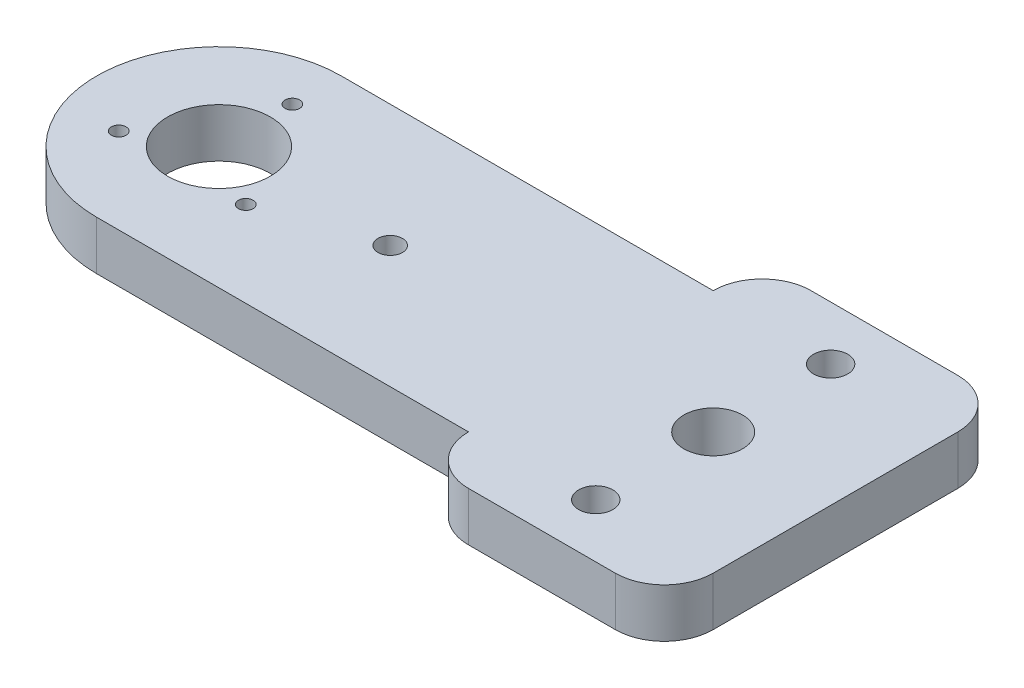
ISO-10303-21;
HEADER;
FILE_DESCRIPTION(('STEP AP214'),'2;1');
FILE_NAME('part.step','',(''),(''),'','','');
FILE_SCHEMA(('AUTOMOTIVE_DESIGN { 1 0 10303 214 1 1 1 1 }'));
ENDSEC;
DATA;
#1=APPLICATION_CONTEXT('core data for automotive mechanical design processes');
#2=APPLICATION_PROTOCOL_DEFINITION('international standard','automotive_design',2000,#1);
#3=PRODUCT_CONTEXT('',#1,'mechanical');
#4=PRODUCT('Part','Part','',(#3));
#5=PRODUCT_RELATED_PRODUCT_CATEGORY('part','',(#4));
#6=PRODUCT_DEFINITION_FORMATION('','',#4);
#7=PRODUCT_DEFINITION_CONTEXT('part definition',#1,'design');
#8=PRODUCT_DEFINITION('design','',#6,#7);
#9=PRODUCT_DEFINITION_SHAPE('','',#8);
#10=(LENGTH_UNIT() NAMED_UNIT(*) SI_UNIT(.MILLI.,.METRE.));
#11=(NAMED_UNIT(*) PLANE_ANGLE_UNIT() SI_UNIT($,.RADIAN.));
#12=(NAMED_UNIT(*) SI_UNIT($,.STERADIAN.) SOLID_ANGLE_UNIT());
#13=UNCERTAINTY_MEASURE_WITH_UNIT(LENGTH_MEASURE(1.E-05),#10,'distance_accuracy_value','');
#14=(GEOMETRIC_REPRESENTATION_CONTEXT(3) GLOBAL_UNCERTAINTY_ASSIGNED_CONTEXT((#13)) GLOBAL_UNIT_ASSIGNED_CONTEXT((#10,
#11,#12)) REPRESENTATION_CONTEXT('',''));
#15=CARTESIAN_POINT('',(0.,0.,0.));
#16=DIRECTION('',(0.,0.,1.));
#17=DIRECTION('',(1.,0.,0.));
#18=AXIS2_PLACEMENT_3D('',#15,#16,#17);
#19=CARTESIAN_POINT('',(126.000002702877,10.,0.));
#20=DIRECTION('',(-1.,0.,0.));
#21=DIRECTION('',(0.,0.,1.));
#22=AXIS2_PLACEMENT_3D('',#19,#20,#21);
#23=PLANE('',#22);
#24=DIRECTION('',(0.,0.,-1.));
#25=VECTOR('',#24,1.);
#26=CARTESIAN_POINT('',(126.000002702877,0.,0.));
#27=LINE('',#26,#25);
#28=CARTESIAN_POINT('',(126.000002702877,0.,25.));
#29=VERTEX_POINT('',#28);
#30=CARTESIAN_POINT('',(126.000002702877,0.,-25.));
#31=VERTEX_POINT('',#30);
#32=EDGE_CURVE('E205',#29,#31,#27,.T.);
#33=ORIENTED_EDGE('',*,*,#32,.T.);
#34=DIRECTION('',(0.,-1.,0.));
#35=VECTOR('',#34,1.);
#36=CARTESIAN_POINT('',(126.000002702877,10.,-25.));
#37=LINE('',#36,#35);
#38=CARTESIAN_POINT('',(126.000002702877,10.,-25.));
#39=VERTEX_POINT('',#38);
#40=EDGE_CURVE('E56',#31,#39,#37,.F.);
#41=ORIENTED_EDGE('',*,*,#40,.T.);
#42=DIRECTION('',(0.,0.,-1.));
#43=VECTOR('',#42,1.);
#44=CARTESIAN_POINT('',(126.000002702877,10.,0.));
#45=LINE('',#44,#43);
#46=CARTESIAN_POINT('',(126.000002702877,10.,25.));
#47=VERTEX_POINT('',#46);
#48=EDGE_CURVE('E375',#47,#39,#45,.T.);
#49=ORIENTED_EDGE('',*,*,#48,.F.);
#50=DIRECTION('',(0.,-1.,0.));
#51=VECTOR('',#50,1.);
#52=CARTESIAN_POINT('',(126.000002702877,10.,25.));
#53=LINE('',#52,#51);
#54=EDGE_CURVE('E154',#47,#29,#53,.T.);
#55=ORIENTED_EDGE('',*,*,#54,.T.);
#56=EDGE_LOOP('',(#33,#41,#49,#55));
#57=FACE_BOUND('',#56,.T.);
#58=ADVANCED_FACE('F47',(#57),#23,.F.);
#59=CARTESIAN_POINT('',(0.,10.,-35.));
#60=DIRECTION('',(0.,0.,-1.));
#61=DIRECTION('',(-1.,0.,0.));
#62=AXIS2_PLACEMENT_3D('',#59,#60,#61);
#63=PLANE('',#62);
#64=DIRECTION('',(1.,0.,0.));
#65=VECTOR('',#64,1.);
#66=CARTESIAN_POINT('',(0.,10.,-35.));
#67=LINE('',#66,#65);
#68=CARTESIAN_POINT('',(86.000002702877,10.,-35.));
#69=VERTEX_POINT('',#68);
#70=CARTESIAN_POINT('',(116.000002702877,10.,-35.));
#71=VERTEX_POINT('',#70);
#72=EDGE_CURVE('E132',#69,#71,#67,.T.);
#73=ORIENTED_EDGE('',*,*,#72,.T.);
#74=DIRECTION('',(0.,-1.,0.));
#75=VECTOR('',#74,1.);
#76=CARTESIAN_POINT('',(116.000002702877,0.,-35.));
#77=LINE('',#76,#75);
#78=CARTESIAN_POINT('',(116.000002702877,0.,-35.));
#79=VERTEX_POINT('',#78);
#80=EDGE_CURVE('E137',#71,#79,#77,.T.);
#81=ORIENTED_EDGE('',*,*,#80,.T.);
#82=DIRECTION('',(1.,0.,0.));
#83=VECTOR('',#82,1.);
#84=CARTESIAN_POINT('',(0.,0.,-35.));
#85=LINE('',#84,#83);
#86=CARTESIAN_POINT('',(86.000002702877,0.,-35.));
#87=VERTEX_POINT('',#86);
#88=EDGE_CURVE('E198',#87,#79,#85,.T.);
#89=ORIENTED_EDGE('',*,*,#88,.F.);
#90=DIRECTION('',(0.,-1.,0.));
#91=VECTOR('',#90,1.);
#92=CARTESIAN_POINT('',(86.000002702877,10.,-35.));
#93=LINE('',#92,#91);
#94=EDGE_CURVE('E138',#87,#69,#93,.F.);
#95=ORIENTED_EDGE('',*,*,#94,.T.);
#96=EDGE_LOOP('',(#73,#81,#89,#95));
#97=FACE_BOUND('',#96,.T.);
#98=ADVANCED_FACE('F197',(#97),#63,.T.);
#99=CARTESIAN_POINT('',(0.,10.,-25.));
#100=DIRECTION('',(0.,0.,-1.));
#101=DIRECTION('',(-1.,0.,0.));
#102=AXIS2_PLACEMENT_3D('',#99,#100,#101);
#103=PLANE('',#102);
#104=DIRECTION('',(1.,0.,0.));
#105=VECTOR('',#104,1.);
#106=CARTESIAN_POINT('',(0.,0.,-25.));
#107=LINE('',#106,#105);
#108=CARTESIAN_POINT('',(0.,0.,-25.));
#109=VERTEX_POINT('',#108);
#110=CARTESIAN_POINT('',(76.000002702877,0.,-25.));
#111=VERTEX_POINT('',#110);
#112=EDGE_CURVE('E204',#109,#111,#107,.T.);
#113=ORIENTED_EDGE('',*,*,#112,.F.);
#114=DIRECTION('',(0.,-1.,0.));
#115=VECTOR('',#114,1.);
#116=CARTESIAN_POINT('',(0.,10.,-25.));
#117=LINE('',#116,#115);
#118=CARTESIAN_POINT('',(0.,10.,-25.));
#119=VERTEX_POINT('',#118);
#120=EDGE_CURVE('E146',#119,#109,#117,.T.);
#121=ORIENTED_EDGE('',*,*,#120,.F.);
#122=DIRECTION('',(1.,0.,0.));
#123=VECTOR('',#122,1.);
#124=CARTESIAN_POINT('',(0.,10.,-25.));
#125=LINE('',#124,#123);
#126=CARTESIAN_POINT('',(76.000002702877,10.,-25.));
#127=VERTEX_POINT('',#126);
#128=EDGE_CURVE('E130',#119,#127,#125,.T.);
#129=ORIENTED_EDGE('',*,*,#128,.T.);
#130=DIRECTION('',(0.,-1.,0.));
#131=VECTOR('',#130,1.);
#132=CARTESIAN_POINT('',(76.000002702877,10.,-25.));
#133=LINE('',#132,#131);
#134=EDGE_CURVE('E144',#127,#111,#133,.T.);
#135=ORIENTED_EDGE('',*,*,#134,.T.);
#136=EDGE_LOOP('',(#113,#121,#129,#135));
#137=FACE_BOUND('',#136,.T.);
#138=ADVANCED_FACE('F143',(#137),#103,.T.);
#139=CARTESIAN_POINT('',(0.,10.,0.));
#140=DIRECTION('',(0.,-1.,0.));
#141=DIRECTION('',(0.,0.,-1.));
#142=AXIS2_PLACEMENT_3D('',#139,#140,#141);
#143=CYLINDRICAL_SURFACE('',#142,25.);
#144=CARTESIAN_POINT('',(0.,0.,0.));
#145=DIRECTION('',(0.,1.,0.));
#146=DIRECTION('',(0.,0.,1.));
#147=AXIS2_PLACEMENT_3D('',#144,#145,#146);
#148=CIRCLE('',#147,25.);
#149=CARTESIAN_POINT('',(0.,0.,25.));
#150=VERTEX_POINT('',#149);
#151=EDGE_CURVE('E209',#109,#150,#148,.T.);
#152=ORIENTED_EDGE('',*,*,#151,.T.);
#153=DIRECTION('',(0.,-1.,0.));
#154=VECTOR('',#153,1.);
#155=CARTESIAN_POINT('',(0.,10.,25.));
#156=LINE('',#155,#154);
#157=CARTESIAN_POINT('',(0.,10.,25.));
#158=VERTEX_POINT('',#157);
#159=EDGE_CURVE('E161',#158,#150,#156,.T.);
#160=ORIENTED_EDGE('',*,*,#159,.F.);
#161=CARTESIAN_POINT('',(0.,10.,0.));
#162=DIRECTION('',(0.,1.,0.));
#163=DIRECTION('',(0.,0.,1.));
#164=AXIS2_PLACEMENT_3D('',#161,#162,#163);
#165=CIRCLE('',#164,25.);
#166=EDGE_CURVE('E149',#119,#158,#165,.T.);
#167=ORIENTED_EDGE('',*,*,#166,.F.);
#168=ORIENTED_EDGE('',*,*,#120,.T.);
#169=EDGE_LOOP('',(#152,#160,#167,#168));
#170=FACE_BOUND('',#169,.T.);
#171=ADVANCED_FACE('F334',(#170),#143,.T.);
#172=CARTESIAN_POINT('',(0.,10.,25.));
#173=DIRECTION('',(0.,0.,-1.));
#174=DIRECTION('',(-1.,0.,0.));
#175=AXIS2_PLACEMENT_3D('',#172,#173,#174);
#176=PLANE('',#175);
#177=DIRECTION('',(1.,0.,0.));
#178=VECTOR('',#177,1.);
#179=CARTESIAN_POINT('',(0.,0.,25.));
#180=LINE('',#179,#178);
#181=CARTESIAN_POINT('',(76.000002702877,0.,25.));
#182=VERTEX_POINT('',#181);
#183=EDGE_CURVE('E217',#150,#182,#180,.T.);
#184=ORIENTED_EDGE('',*,*,#183,.T.);
#185=DIRECTION('',(0.,-1.,0.));
#186=VECTOR('',#185,1.);
#187=CARTESIAN_POINT('',(76.000002702877,10.,25.));
#188=LINE('',#187,#186);
#189=CARTESIAN_POINT('',(76.000002702877,10.,25.));
#190=VERTEX_POINT('',#189);
#191=EDGE_CURVE('E245',#190,#182,#188,.T.);
#192=ORIENTED_EDGE('',*,*,#191,.F.);
#193=DIRECTION('',(1.,0.,0.));
#194=VECTOR('',#193,1.);
#195=CARTESIAN_POINT('',(0.,10.,25.));
#196=LINE('',#195,#194);
#197=EDGE_CURVE('E257',#158,#190,#196,.T.);
#198=ORIENTED_EDGE('',*,*,#197,.F.);
#199=ORIENTED_EDGE('',*,*,#159,.T.);
#200=EDGE_LOOP('',(#184,#192,#198,#199));
#201=FACE_BOUND('',#200,.T.);
#202=ADVANCED_FACE('F255',(#201),#176,.F.);
#203=CARTESIAN_POINT('',(101.000002702877,10.,23.9999999999994));
#204=DIRECTION('',(0.,-1.,0.));
#205=DIRECTION('',(0.,0.,-1.));
#206=AXIS2_PLACEMENT_3D('',#203,#204,#205);
#207=CYLINDRICAL_SURFACE('',#206,3.50000000000213);
#208=CARTESIAN_POINT('',(101.000002702877,10.,23.9999999999994));
#209=DIRECTION('',(0.,1.,0.));
#210=DIRECTION('',(0.,0.,1.));
#211=AXIS2_PLACEMENT_3D('',#208,#209,#210);
#212=CIRCLE('',#211,3.50000000000213);
#213=CARTESIAN_POINT('',(101.000002702877,10.,27.5000000000015));
#214=VERTEX_POINT('',#213);
#215=EDGE_CURVE('E289',#214,#214,#212,.F.);
#216=ORIENTED_EDGE('',*,*,#215,.F.);
#217=EDGE_LOOP('',(#216));
#218=FACE_BOUND('',#217,.T.);
#219=CARTESIAN_POINT('',(101.000002702877,0.,23.9999999999994));
#220=DIRECTION('',(0.,1.,0.));
#221=DIRECTION('',(0.,0.,1.));
#222=AXIS2_PLACEMENT_3D('',#219,#220,#221);
#223=CIRCLE('',#222,3.50000000000213);
#224=CARTESIAN_POINT('',(101.000002702877,0.,27.5000000000015));
#225=VERTEX_POINT('',#224);
#226=EDGE_CURVE('E236',#225,#225,#223,.F.);
#227=ORIENTED_EDGE('',*,*,#226,.T.);
#228=EDGE_LOOP('',(#227));
#229=FACE_BOUND('',#228,.T.);
#230=ADVANCED_FACE('F338',(#218,#229),#207,.F.);
#231=CARTESIAN_POINT('',(35.,10.,0.));
#232=DIRECTION('',(0.,-1.,0.));
#233=DIRECTION('',(0.,0.,-1.));
#234=AXIS2_PLACEMENT_3D('',#231,#232,#233);
#235=CYLINDRICAL_SURFACE('',#234,2.5);
#236=CARTESIAN_POINT('',(35.,10.,0.));
#237=DIRECTION('',(0.,1.,0.));
#238=DIRECTION('',(0.,0.,1.));
#239=AXIS2_PLACEMENT_3D('',#236,#237,#238);
#240=CIRCLE('',#239,2.5);
#241=CARTESIAN_POINT('',(35.,10.,2.5));
#242=VERTEX_POINT('',#241);
#243=EDGE_CURVE('E285',#242,#242,#240,.T.);
#244=ORIENTED_EDGE('',*,*,#243,.T.);
#245=EDGE_LOOP('',(#244));
#246=FACE_BOUND('',#245,.T.);
#247=CARTESIAN_POINT('',(35.,0.,0.));
#248=DIRECTION('',(0.,1.,0.));
#249=DIRECTION('',(0.,0.,1.));
#250=AXIS2_PLACEMENT_3D('',#247,#248,#249);
#251=CIRCLE('',#250,2.5);
#252=CARTESIAN_POINT('',(35.,0.,2.5));
#253=VERTEX_POINT('',#252);
#254=EDGE_CURVE('E232',#253,#253,#251,.T.);
#255=ORIENTED_EDGE('',*,*,#254,.F.);
#256=EDGE_LOOP('',(#255));
#257=FACE_BOUND('',#256,.T.);
#258=ADVANCED_FACE('F345',(#246,#257),#235,.F.);
#259=CARTESIAN_POINT('',(0.,10.,-15.));
#260=DIRECTION('',(0.,-1.,0.));
#261=DIRECTION('',(0.,0.,-1.));
#262=AXIS2_PLACEMENT_3D('',#259,#260,#261);
#263=CYLINDRICAL_SURFACE('',#262,1.5);
#264=CARTESIAN_POINT('',(0.,10.,-15.));
#265=DIRECTION('',(0.,1.,0.));
#266=DIRECTION('',(0.,0.,1.));
#267=AXIS2_PLACEMENT_3D('',#264,#265,#266);
#268=CIRCLE('',#267,1.5);
#269=CARTESIAN_POINT('',(0.,10.,-13.5));
#270=VERTEX_POINT('',#269);
#271=EDGE_CURVE('E277',#270,#270,#268,.T.);
#272=ORIENTED_EDGE('',*,*,#271,.T.);
#273=EDGE_LOOP('',(#272));
#274=FACE_BOUND('',#273,.T.);
#275=CARTESIAN_POINT('',(0.,0.,-15.));
#276=DIRECTION('',(0.,1.,0.));
#277=DIRECTION('',(0.,0.,1.));
#278=AXIS2_PLACEMENT_3D('',#275,#276,#277);
#279=CIRCLE('',#278,1.5);
#280=CARTESIAN_POINT('',(0.,0.,-13.5));
#281=VERTEX_POINT('',#280);
#282=EDGE_CURVE('E228',#281,#281,#279,.T.);
#283=ORIENTED_EDGE('',*,*,#282,.F.);
#284=EDGE_LOOP('',(#283));
#285=FACE_BOUND('',#284,.T.);
#286=ADVANCED_FACE('F341',(#274,#285),#263,.F.);
#287=CARTESIAN_POINT('',(101.000002702877,10.,-23.9999999999994));
#288=DIRECTION('',(0.,-1.,0.));
#289=DIRECTION('',(0.,0.,-1.));
#290=AXIS2_PLACEMENT_3D('',#287,#288,#289);
#291=CYLINDRICAL_SURFACE('',#290,3.50000000000213);
#292=CARTESIAN_POINT('',(101.000002702877,10.,-23.9999999999994));
#293=DIRECTION('',(0.,1.,0.));
#294=DIRECTION('',(0.,0.,1.));
#295=AXIS2_PLACEMENT_3D('',#292,#293,#294);
#296=CIRCLE('',#295,3.50000000000213);
#297=CARTESIAN_POINT('',(101.000002702877,10.,-20.4999999999972));
#298=VERTEX_POINT('',#297);
#299=EDGE_CURVE('E272',#298,#298,#296,.T.);
#300=ORIENTED_EDGE('',*,*,#299,.T.);
#301=EDGE_LOOP('',(#300));
#302=FACE_BOUND('',#301,.T.);
#303=CARTESIAN_POINT('',(101.000002702877,0.,-23.9999999999994));
#304=DIRECTION('',(0.,1.,0.));
#305=DIRECTION('',(0.,0.,1.));
#306=AXIS2_PLACEMENT_3D('',#303,#304,#305);
#307=CIRCLE('',#306,3.50000000000213);
#308=CARTESIAN_POINT('',(101.000002702877,0.,-20.4999999999972));
#309=VERTEX_POINT('',#308);
#310=EDGE_CURVE('E224',#309,#309,#307,.T.);
#311=ORIENTED_EDGE('',*,*,#310,.F.);
#312=EDGE_LOOP('',(#311));
#313=FACE_BOUND('',#312,.T.);
#314=ADVANCED_FACE('F321',(#302,#313),#291,.F.);
#315=CARTESIAN_POINT('',(0.,10.,35.));
#316=DIRECTION('',(0.,0.,-1.));
#317=DIRECTION('',(-1.,0.,0.));
#318=AXIS2_PLACEMENT_3D('',#315,#316,#317);
#319=PLANE('',#318);
#320=DIRECTION('',(1.,0.,0.));
#321=VECTOR('',#320,1.);
#322=CARTESIAN_POINT('',(0.,10.,35.));
#323=LINE('',#322,#321);
#324=CARTESIAN_POINT('',(86.000002702877,10.,35.));
#325=VERTEX_POINT('',#324);
#326=CARTESIAN_POINT('',(116.000002702877,10.,35.));
#327=VERTEX_POINT('',#326);
#328=EDGE_CURVE('E268',#325,#327,#323,.T.);
#329=ORIENTED_EDGE('',*,*,#328,.F.);
#330=DIRECTION('',(0.,-1.,0.));
#331=VECTOR('',#330,1.);
#332=CARTESIAN_POINT('',(86.000002702877,0.,35.));
#333=LINE('',#332,#331);
#334=CARTESIAN_POINT('',(86.000002702877,0.,35.));
#335=VERTEX_POINT('',#334);
#336=EDGE_CURVE('E175',#325,#335,#333,.T.);
#337=ORIENTED_EDGE('',*,*,#336,.T.);
#338=DIRECTION('',(1.,0.,0.));
#339=VECTOR('',#338,1.);
#340=CARTESIAN_POINT('',(0.,0.,35.));
#341=LINE('',#340,#339);
#342=CARTESIAN_POINT('',(116.000002702877,0.,35.));
#343=VERTEX_POINT('',#342);
#344=EDGE_CURVE('E221',#335,#343,#341,.T.);
#345=ORIENTED_EDGE('',*,*,#344,.T.);
#346=DIRECTION('',(0.,-1.,0.));
#347=VECTOR('',#346,1.);
#348=CARTESIAN_POINT('',(116.000002702877,10.,35.));
#349=LINE('',#348,#347);
#350=EDGE_CURVE('E168',#343,#327,#349,.F.);
#351=ORIENTED_EDGE('',*,*,#350,.T.);
#352=EDGE_LOOP('',(#329,#337,#345,#351));
#353=FACE_BOUND('',#352,.T.);
#354=ADVANCED_FACE('F267',(#353),#319,.F.);
#355=CARTESIAN_POINT('',(-12.9903763556468,10.,7.50000814257245));
#356=DIRECTION('',(0.,-1.,0.));
#357=DIRECTION('',(0.,0.,-1.));
#358=AXIS2_PLACEMENT_3D('',#355,#356,#357);
#359=CYLINDRICAL_SURFACE('',#358,1.5);
#360=CARTESIAN_POINT('',(-12.9903763556468,10.,7.50000814257245));
#361=DIRECTION('',(0.,1.,0.));
#362=DIRECTION('',(0.,0.,1.));
#363=AXIS2_PLACEMENT_3D('',#360,#361,#362);
#364=CIRCLE('',#363,1.5);
#365=CARTESIAN_POINT('',(-12.9903763556468,10.,9.00000814257245));
#366=VERTEX_POINT('',#365);
#367=EDGE_CURVE('E373',#366,#366,#364,.T.);
#368=ORIENTED_EDGE('',*,*,#367,.T.);
#369=EDGE_LOOP('',(#368));
#370=FACE_BOUND('',#369,.T.);
#371=CARTESIAN_POINT('',(-12.9903763556468,0.,7.50000814257245));
#372=DIRECTION('',(0.,1.,0.));
#373=DIRECTION('',(0.,0.,1.));
#374=AXIS2_PLACEMENT_3D('',#371,#372,#373);
#375=CIRCLE('',#374,1.5);
#376=CARTESIAN_POINT('',(-12.9903763556468,0.,9.00000814257245));
#377=VERTEX_POINT('',#376);
#378=EDGE_CURVE('E211',#377,#377,#375,.T.);
#379=ORIENTED_EDGE('',*,*,#378,.F.);
#380=EDGE_LOOP('',(#379));
#381=FACE_BOUND('',#380,.T.);
#382=ADVANCED_FACE('F308',(#370,#381),#359,.F.);
#383=CARTESIAN_POINT('',(12.9903775339227,10.,7.49999796608509));
#384=DIRECTION('',(0.,-1.,0.));
#385=DIRECTION('',(0.,0.,-1.));
#386=AXIS2_PLACEMENT_3D('',#383,#384,#385);
#387=CYLINDRICAL_SURFACE('',#386,1.5);
#388=CARTESIAN_POINT('',(12.9903775339227,10.,7.49999796608509));
#389=DIRECTION('',(0.,1.,0.));
#390=DIRECTION('',(0.,0.,1.));
#391=AXIS2_PLACEMENT_3D('',#388,#389,#390);
#392=CIRCLE('',#391,1.5);
#393=CARTESIAN_POINT('',(12.9903775339227,10.,8.99999796608509));
#394=VERTEX_POINT('',#393);
#395=EDGE_CURVE('E371',#394,#394,#392,.T.);
#396=ORIENTED_EDGE('',*,*,#395,.T.);
#397=EDGE_LOOP('',(#396));
#398=FACE_BOUND('',#397,.T.);
#399=CARTESIAN_POINT('',(12.9903775339227,0.,7.49999796608509));
#400=DIRECTION('',(0.,1.,0.));
#401=DIRECTION('',(0.,0.,1.));
#402=AXIS2_PLACEMENT_3D('',#399,#400,#401);
#403=CIRCLE('',#402,1.5);
#404=CARTESIAN_POINT('',(12.9903775339227,0.,8.99999796608509));
#405=VERTEX_POINT('',#404);
#406=EDGE_CURVE('E300',#405,#405,#403,.T.);
#407=ORIENTED_EDGE('',*,*,#406,.F.);
#408=EDGE_LOOP('',(#407));
#409=FACE_BOUND('',#408,.T.);
#410=ADVANCED_FACE('F310',(#398,#409),#387,.F.);
#411=CARTESIAN_POINT('',(0.,10.,0.));
#412=DIRECTION('',(0.,-1.,0.));
#413=DIRECTION('',(0.,0.,-1.));
#414=AXIS2_PLACEMENT_3D('',#411,#412,#413);
#415=CYLINDRICAL_SURFACE('',#414,10.5);
#416=CARTESIAN_POINT('',(0.,10.,0.));
#417=DIRECTION('',(0.,1.,0.));
#418=DIRECTION('',(0.,0.,1.));
#419=AXIS2_PLACEMENT_3D('',#416,#417,#418);
#420=CIRCLE('',#419,10.5);
#421=CARTESIAN_POINT('',(0.,10.,10.5));
#422=VERTEX_POINT('',#421);
#423=EDGE_CURVE('E244',#422,#422,#420,.T.);
#424=ORIENTED_EDGE('',*,*,#423,.T.);
#425=EDGE_LOOP('',(#424));
#426=FACE_BOUND('',#425,.T.);
#427=CARTESIAN_POINT('',(0.,0.,0.));
#428=DIRECTION('',(0.,1.,0.));
#429=DIRECTION('',(0.,0.,1.));
#430=AXIS2_PLACEMENT_3D('',#427,#428,#429);
#431=CIRCLE('',#430,10.5);
#432=CARTESIAN_POINT('',(0.,0.,10.5));
#433=VERTEX_POINT('',#432);
#434=EDGE_CURVE('E296',#433,#433,#431,.T.);
#435=ORIENTED_EDGE('',*,*,#434,.F.);
#436=EDGE_LOOP('',(#435));
#437=FACE_BOUND('',#436,.T.);
#438=ADVANCED_FACE('F317',(#426,#437),#415,.F.);
#439=CARTESIAN_POINT('',(101.000002702877,10.,0.));
#440=DIRECTION('',(0.,-1.,0.));
#441=DIRECTION('',(0.,0.,-1.));
#442=AXIS2_PLACEMENT_3D('',#439,#440,#441);
#443=CYLINDRICAL_SURFACE('',#442,6.);
#444=CARTESIAN_POINT('',(101.000002702877,10.,0.));
#445=DIRECTION('',(0.,1.,0.));
#446=DIRECTION('',(0.,0.,1.));
#447=AXIS2_PLACEMENT_3D('',#444,#445,#446);
#448=CIRCLE('',#447,6.);
#449=CARTESIAN_POINT('',(101.000002702877,10.,6.));
#450=VERTEX_POINT('',#449);
#451=EDGE_CURVE('E248',#450,#450,#448,.T.);
#452=ORIENTED_EDGE('',*,*,#451,.T.);
#453=EDGE_LOOP('',(#452));
#454=FACE_BOUND('',#453,.T.);
#455=CARTESIAN_POINT('',(101.000002702877,0.,0.));
#456=DIRECTION('',(0.,1.,0.));
#457=DIRECTION('',(0.,0.,1.));
#458=AXIS2_PLACEMENT_3D('',#455,#456,#457);
#459=CIRCLE('',#458,6.);
#460=CARTESIAN_POINT('',(101.000002702877,0.,6.));
#461=VERTEX_POINT('',#460);
#462=EDGE_CURVE('E240',#461,#461,#459,.T.);
#463=ORIENTED_EDGE('',*,*,#462,.F.);
#464=EDGE_LOOP('',(#463));
#465=FACE_BOUND('',#464,.T.);
#466=ADVANCED_FACE('F353',(#454,#465),#443,.F.);
#467=CARTESIAN_POINT('',(0.,10.,0.));
#468=DIRECTION('',(0.,1.,0.));
#469=DIRECTION('',(0.,0.,1.));
#470=AXIS2_PLACEMENT_3D('',#467,#468,#469);
#471=PLANE('',#470);
#472=ORIENTED_EDGE('',*,*,#423,.F.);
#473=EDGE_LOOP('',(#472));
#474=FACE_BOUND('',#473,.T.);
#475=ORIENTED_EDGE('',*,*,#395,.F.);
#476=EDGE_LOOP('',(#475));
#477=FACE_BOUND('',#476,.T.);
#478=ORIENTED_EDGE('',*,*,#367,.F.);
#479=EDGE_LOOP('',(#478));
#480=FACE_BOUND('',#479,.T.);
#481=ORIENTED_EDGE('',*,*,#48,.T.);
#482=CARTESIAN_POINT('',(116.000002702877,10.,-25.));
#483=DIRECTION('',(0.,1.,0.));
#484=DIRECTION('',(0.,0.,1.));
#485=AXIS2_PLACEMENT_3D('',#482,#483,#484);
#486=CIRCLE('',#485,10.);
#487=EDGE_CURVE('E11',#39,#71,#486,.T.);
#488=ORIENTED_EDGE('',*,*,#487,.T.);
#489=ORIENTED_EDGE('',*,*,#72,.F.);
#490=CARTESIAN_POINT('',(86.000002702877,10.,-25.));
#491=DIRECTION('',(0.,1.,0.));
#492=DIRECTION('',(0.,0.,1.));
#493=AXIS2_PLACEMENT_3D('',#490,#491,#492);
#494=CIRCLE('',#493,10.);
#495=EDGE_CURVE('E126',#69,#127,#494,.T.);
#496=ORIENTED_EDGE('',*,*,#495,.T.);
#497=ORIENTED_EDGE('',*,*,#128,.F.);
#498=ORIENTED_EDGE('',*,*,#166,.T.);
#499=ORIENTED_EDGE('',*,*,#197,.T.);
#500=CARTESIAN_POINT('',(86.000002702877,10.,25.));
#501=DIRECTION('',(0.,1.,0.));
#502=DIRECTION('',(0.,0.,1.));
#503=AXIS2_PLACEMENT_3D('',#500,#501,#502);
#504=CIRCLE('',#503,10.);
#505=EDGE_CURVE('E182',#190,#325,#504,.T.);
#506=ORIENTED_EDGE('',*,*,#505,.T.);
#507=ORIENTED_EDGE('',*,*,#328,.T.);
#508=CARTESIAN_POINT('',(116.000002702877,10.,25.));
#509=DIRECTION('',(0.,1.,0.));
#510=DIRECTION('',(0.,0.,1.));
#511=AXIS2_PLACEMENT_3D('',#508,#509,#510);
#512=CIRCLE('',#511,10.);
#513=EDGE_CURVE('E172',#327,#47,#512,.T.);
#514=ORIENTED_EDGE('',*,*,#513,.T.);
#515=EDGE_LOOP('',(#481,#488,#489,#496,#497,#498,#499,#506,#507,#514));
#516=FACE_BOUND('',#515,.T.);
#517=ORIENTED_EDGE('',*,*,#299,.F.);
#518=EDGE_LOOP('',(#517));
#519=FACE_BOUND('',#518,.T.);
#520=ORIENTED_EDGE('',*,*,#271,.F.);
#521=EDGE_LOOP('',(#520));
#522=FACE_BOUND('',#521,.T.);
#523=ORIENTED_EDGE('',*,*,#243,.F.);
#524=EDGE_LOOP('',(#523));
#525=FACE_BOUND('',#524,.T.);
#526=ORIENTED_EDGE('',*,*,#215,.T.);
#527=EDGE_LOOP('',(#526));
#528=FACE_BOUND('',#527,.T.);
#529=ORIENTED_EDGE('',*,*,#451,.F.);
#530=EDGE_LOOP('',(#529));
#531=FACE_BOUND('',#530,.T.);
#532=ADVANCED_FACE('F128',(#474,#477,#480,#516,#519,#522,#525,#528,#531),#471,.T.);
#533=CARTESIAN_POINT('',(0.,0.,0.));
#534=DIRECTION('',(0.,1.,0.));
#535=DIRECTION('',(0.,0.,1.));
#536=AXIS2_PLACEMENT_3D('',#533,#534,#535);
#537=PLANE('',#536);
#538=ORIENTED_EDGE('',*,*,#434,.T.);
#539=EDGE_LOOP('',(#538));
#540=FACE_BOUND('',#539,.T.);
#541=ORIENTED_EDGE('',*,*,#406,.T.);
#542=EDGE_LOOP('',(#541));
#543=FACE_BOUND('',#542,.T.);
#544=ORIENTED_EDGE('',*,*,#378,.T.);
#545=EDGE_LOOP('',(#544));
#546=FACE_BOUND('',#545,.T.);
#547=ORIENTED_EDGE('',*,*,#88,.T.);
#548=CARTESIAN_POINT('',(116.000002702877,0.,-25.));
#549=DIRECTION('',(0.,1.,0.));
#550=DIRECTION('',(0.,0.,1.));
#551=AXIS2_PLACEMENT_3D('',#548,#549,#550);
#552=CIRCLE('',#551,10.);
#553=EDGE_CURVE('E70',#79,#31,#552,.F.);
#554=ORIENTED_EDGE('',*,*,#553,.T.);
#555=ORIENTED_EDGE('',*,*,#32,.F.);
#556=CARTESIAN_POINT('',(116.000002702877,0.,25.));
#557=DIRECTION('',(0.,1.,0.));
#558=DIRECTION('',(0.,0.,1.));
#559=AXIS2_PLACEMENT_3D('',#556,#557,#558);
#560=CIRCLE('',#559,10.);
#561=EDGE_CURVE('E159',#29,#343,#560,.F.);
#562=ORIENTED_EDGE('',*,*,#561,.T.);
#563=ORIENTED_EDGE('',*,*,#344,.F.);
#564=CARTESIAN_POINT('',(86.000002702877,0.,25.));
#565=DIRECTION('',(0.,1.,0.));
#566=DIRECTION('',(0.,0.,1.));
#567=AXIS2_PLACEMENT_3D('',#564,#565,#566);
#568=CIRCLE('',#567,10.);
#569=EDGE_CURVE('E179',#335,#182,#568,.F.);
#570=ORIENTED_EDGE('',*,*,#569,.T.);
#571=ORIENTED_EDGE('',*,*,#183,.F.);
#572=ORIENTED_EDGE('',*,*,#151,.F.);
#573=ORIENTED_EDGE('',*,*,#112,.T.);
#574=CARTESIAN_POINT('',(86.000002702877,0.,-25.));
#575=DIRECTION('',(0.,1.,0.));
#576=DIRECTION('',(0.,0.,1.));
#577=AXIS2_PLACEMENT_3D('',#574,#575,#576);
#578=CIRCLE('',#577,10.);
#579=EDGE_CURVE('E152',#111,#87,#578,.F.);
#580=ORIENTED_EDGE('',*,*,#579,.T.);
#581=EDGE_LOOP('',(#547,#554,#555,#562,#563,#570,#571,#572,#573,#580));
#582=FACE_BOUND('',#581,.T.);
#583=ORIENTED_EDGE('',*,*,#310,.T.);
#584=EDGE_LOOP('',(#583));
#585=FACE_BOUND('',#584,.T.);
#586=ORIENTED_EDGE('',*,*,#282,.T.);
#587=EDGE_LOOP('',(#586));
#588=FACE_BOUND('',#587,.T.);
#589=ORIENTED_EDGE('',*,*,#254,.T.);
#590=EDGE_LOOP('',(#589));
#591=FACE_BOUND('',#590,.T.);
#592=ORIENTED_EDGE('',*,*,#226,.F.);
#593=EDGE_LOOP('',(#592));
#594=FACE_BOUND('',#593,.T.);
#595=ORIENTED_EDGE('',*,*,#462,.T.);
#596=EDGE_LOOP('',(#595));
#597=FACE_BOUND('',#596,.T.);
#598=ADVANCED_FACE('F201',(#540,#543,#546,#582,#585,#588,#591,#594,#597),#537,.F.);
#599=CARTESIAN_POINT('',(116.000002702877,10.,25.));
#600=DIRECTION('',(0.,-1.,0.));
#601=DIRECTION('',(0.,0.,-1.));
#602=AXIS2_PLACEMENT_3D('',#599,#600,#601);
#603=CYLINDRICAL_SURFACE('',#602,10.);
#604=ORIENTED_EDGE('',*,*,#513,.F.);
#605=ORIENTED_EDGE('',*,*,#350,.F.);
#606=ORIENTED_EDGE('',*,*,#561,.F.);
#607=ORIENTED_EDGE('',*,*,#54,.F.);
#608=EDGE_LOOP('',(#604,#605,#606,#607));
#609=FACE_BOUND('',#608,.T.);
#610=ADVANCED_FACE('F359',(#609),#603,.T.);
#611=CARTESIAN_POINT('',(86.000002702877,10.,25.));
#612=DIRECTION('',(0.,1.,0.));
#613=DIRECTION('',(0.,0.,1.));
#614=AXIS2_PLACEMENT_3D('',#611,#612,#613);
#615=CYLINDRICAL_SURFACE('',#614,10.);
#616=ORIENTED_EDGE('',*,*,#505,.F.);
#617=ORIENTED_EDGE('',*,*,#191,.T.);
#618=ORIENTED_EDGE('',*,*,#569,.F.);
#619=ORIENTED_EDGE('',*,*,#336,.F.);
#620=EDGE_LOOP('',(#616,#617,#618,#619));
#621=FACE_BOUND('',#620,.T.);
#622=ADVANCED_FACE('F264',(#621),#615,.T.);
#623=CARTESIAN_POINT('',(86.000002702877,10.,-25.));
#624=DIRECTION('',(0.,-1.,0.));
#625=DIRECTION('',(0.,0.,-1.));
#626=AXIS2_PLACEMENT_3D('',#623,#624,#625);
#627=CYLINDRICAL_SURFACE('',#626,10.);
#628=ORIENTED_EDGE('',*,*,#495,.F.);
#629=ORIENTED_EDGE('',*,*,#94,.F.);
#630=ORIENTED_EDGE('',*,*,#579,.F.);
#631=ORIENTED_EDGE('',*,*,#134,.F.);
#632=EDGE_LOOP('',(#628,#629,#630,#631));
#633=FACE_BOUND('',#632,.T.);
#634=ADVANCED_FACE('F151',(#633),#627,.T.);
#635=CARTESIAN_POINT('',(116.000002702877,10.,-25.));
#636=DIRECTION('',(0.,1.,0.));
#637=DIRECTION('',(0.,0.,1.));
#638=AXIS2_PLACEMENT_3D('',#635,#636,#637);
#639=CYLINDRICAL_SURFACE('',#638,10.);
#640=ORIENTED_EDGE('',*,*,#487,.F.);
#641=ORIENTED_EDGE('',*,*,#40,.F.);
#642=ORIENTED_EDGE('',*,*,#553,.F.);
#643=ORIENTED_EDGE('',*,*,#80,.F.);
#644=EDGE_LOOP('',(#640,#641,#642,#643));
#645=FACE_BOUND('',#644,.T.);
#646=ADVANCED_FACE('F49',(#645),#639,.T.);
#647=CLOSED_SHELL('',(#58,#98,#138,#171,#202,#230,#258,#286,#314,#354,#382,#410,#438,#466,#532,
#598,#610,#622,#634,#646));
#648=MANIFOLD_SOLID_BREP('B2',#647);
#649=ADVANCED_BREP_SHAPE_REPRESENTATION('',(#18,#648),#14);
#650=SHAPE_DEFINITION_REPRESENTATION(#9,#649);
ENDSEC;
END-ISO-10303-21;
